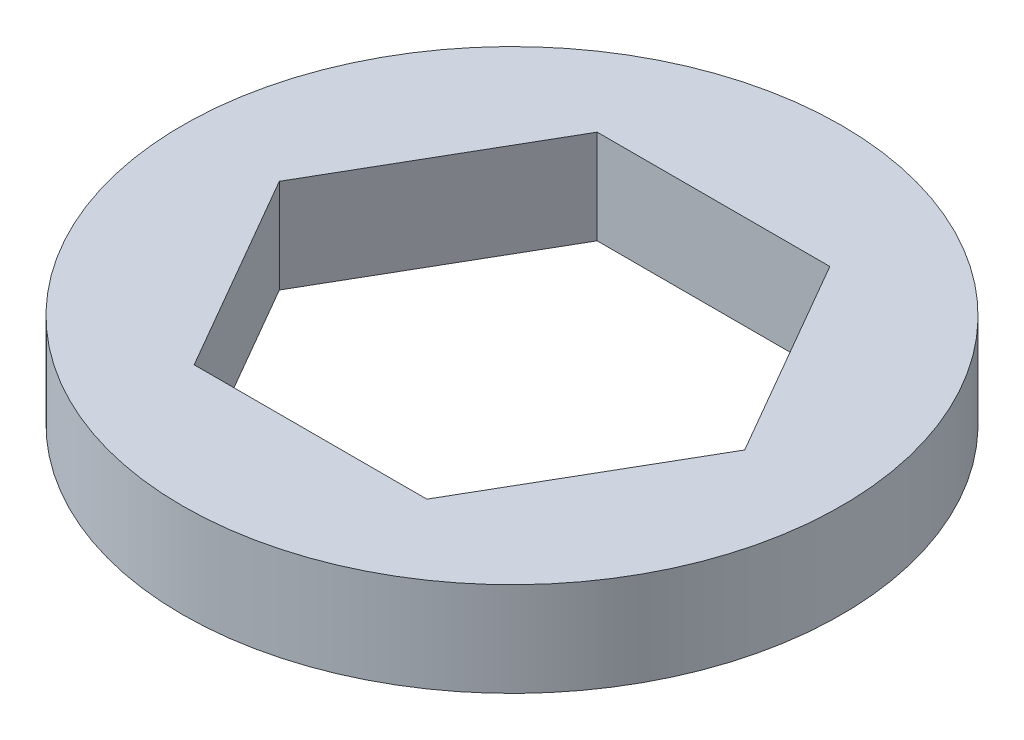
ISO-10303-21;
HEADER;
FILE_DESCRIPTION(('STEP AP214'),'2;1');
FILE_NAME('part.step','',(''),(''),'','','');
FILE_SCHEMA(('AUTOMOTIVE_DESIGN { 1 0 10303 214 1 1 1 1 }'));
ENDSEC;
DATA;
#1=APPLICATION_CONTEXT('core data for automotive mechanical design processes');
#2=APPLICATION_PROTOCOL_DEFINITION('international standard','automotive_design',2000,#1);
#3=PRODUCT_CONTEXT('',#1,'mechanical');
#4=PRODUCT('Part','Part','',(#3));
#5=PRODUCT_RELATED_PRODUCT_CATEGORY('part','',(#4));
#6=PRODUCT_DEFINITION_FORMATION('','',#4);
#7=PRODUCT_DEFINITION_CONTEXT('part definition',#1,'design');
#8=PRODUCT_DEFINITION('design','',#6,#7);
#9=PRODUCT_DEFINITION_SHAPE('','',#8);
#10=(LENGTH_UNIT() NAMED_UNIT(*) SI_UNIT(.MILLI.,.METRE.));
#11=(NAMED_UNIT(*) PLANE_ANGLE_UNIT() SI_UNIT($,.RADIAN.));
#12=(NAMED_UNIT(*) SI_UNIT($,.STERADIAN.) SOLID_ANGLE_UNIT());
#13=UNCERTAINTY_MEASURE_WITH_UNIT(LENGTH_MEASURE(1.E-05),#10,'distance_accuracy_value','');
#14=(GEOMETRIC_REPRESENTATION_CONTEXT(3) GLOBAL_UNCERTAINTY_ASSIGNED_CONTEXT((#13)) GLOBAL_UNIT_ASSIGNED_CONTEXT((#10,
#11,#12)) REPRESENTATION_CONTEXT('',''));
#15=CARTESIAN_POINT('',(0.,0.,0.));
#16=DIRECTION('',(0.,0.,1.));
#17=DIRECTION('',(1.,0.,0.));
#18=AXIS2_PLACEMENT_3D('',#15,#16,#17);
#19=CARTESIAN_POINT('',(0.,3.175,0.));
#20=DIRECTION('',(0.,1.,0.));
#21=DIRECTION('',(0.,0.,1.));
#22=AXIS2_PLACEMENT_3D('',#19,#20,#21);
#23=PLANE('',#22);
#24=CARTESIAN_POINT('',(0.,3.175,0.));
#25=DIRECTION('',(0.,1.,0.));
#26=DIRECTION('',(0.,0.,1.));
#27=AXIS2_PLACEMENT_3D('',#24,#25,#26);
#28=CIRCLE('',#27,11.1125);
#29=CARTESIAN_POINT('',(0.,3.175,11.1125));
#30=VERTEX_POINT('',#29);
#31=EDGE_CURVE('E11',#30,#30,#28,.T.);
#32=ORIENTED_EDGE('',*,*,#31,.T.);
#33=EDGE_LOOP('',(#32));
#34=FACE_BOUND('',#33,.T.);
#35=DIRECTION('',(-0.5,0.,-0.866025403784439));
#36=VECTOR('',#35,1.);
#37=CARTESIAN_POINT('',(7.84561280801783,3.175,0.));
#38=LINE('',#37,#36);
#39=CARTESIAN_POINT('',(7.84561280801783,3.175,0.));
#40=VERTEX_POINT('',#39);
#41=CARTESIAN_POINT('',(3.9228064040089,3.175,-6.79450000000002));
#42=VERTEX_POINT('',#41);
#43=EDGE_CURVE('E93',#40,#42,#38,.T.);
#44=ORIENTED_EDGE('',*,*,#43,.F.);
#45=DIRECTION('',(0.5,0.,-0.866025403784439));
#46=VECTOR('',#45,1.);
#47=CARTESIAN_POINT('',(3.92280640400891,3.175,6.79450000000001));
#48=LINE('',#47,#46);
#49=CARTESIAN_POINT('',(3.92280640400891,3.175,6.79450000000001));
#50=VERTEX_POINT('',#49);
#51=EDGE_CURVE('E85',#50,#40,#48,.T.);
#52=ORIENTED_EDGE('',*,*,#51,.F.);
#53=DIRECTION('',(1.,0.,0.));
#54=VECTOR('',#53,1.);
#55=CARTESIAN_POINT('',(-3.92280640400892,3.175,6.79450000000001));
#56=LINE('',#55,#54);
#57=CARTESIAN_POINT('',(-3.92280640400892,3.175,6.79450000000001));
#58=VERTEX_POINT('',#57);
#59=EDGE_CURVE('E113',#58,#50,#56,.T.);
#60=ORIENTED_EDGE('',*,*,#59,.F.);
#61=DIRECTION('',(0.5,0.,0.866025403784439));
#62=VECTOR('',#61,1.);
#63=CARTESIAN_POINT('',(-7.84561280801784,3.175,0.));
#64=LINE('',#63,#62);
#65=CARTESIAN_POINT('',(-7.84561280801784,3.175,0.));
#66=VERTEX_POINT('',#65);
#67=EDGE_CURVE('E111',#66,#58,#64,.T.);
#68=ORIENTED_EDGE('',*,*,#67,.F.);
#69=DIRECTION('',(-0.5,0.,0.866025403784439));
#70=VECTOR('',#69,1.);
#71=CARTESIAN_POINT('',(-3.92280640400892,3.175,-6.79450000000002));
#72=LINE('',#71,#70);
#73=CARTESIAN_POINT('',(-3.92280640400892,3.175,-6.79450000000002));
#74=VERTEX_POINT('',#73);
#75=EDGE_CURVE('E107',#74,#66,#72,.T.);
#76=ORIENTED_EDGE('',*,*,#75,.F.);
#77=DIRECTION('',(-1.,0.,0.));
#78=VECTOR('',#77,1.);
#79=CARTESIAN_POINT('',(3.9228064040089,3.175,-6.79450000000002));
#80=LINE('',#79,#78);
#81=EDGE_CURVE('E105',#42,#74,#80,.T.);
#82=ORIENTED_EDGE('',*,*,#81,.F.);
#83=EDGE_LOOP('',(#44,#52,#60,#68,#76,#82));
#84=FACE_BOUND('',#83,.T.);
#85=ADVANCED_FACE('F32',(#34,#84),#23,.T.);
#86=CARTESIAN_POINT('',(0.,0.,0.));
#87=DIRECTION('',(0.,1.,0.));
#88=DIRECTION('',(0.,0.,1.));
#89=AXIS2_PLACEMENT_3D('',#86,#87,#88);
#90=PLANE('',#89);
#91=CARTESIAN_POINT('',(0.,0.,0.));
#92=DIRECTION('',(0.,1.,0.));
#93=DIRECTION('',(0.,0.,1.));
#94=AXIS2_PLACEMENT_3D('',#91,#92,#93);
#95=CIRCLE('',#94,11.1125);
#96=CARTESIAN_POINT('',(0.,0.,11.1125));
#97=VERTEX_POINT('',#96);
#98=EDGE_CURVE('E36',#97,#97,#95,.T.);
#99=ORIENTED_EDGE('',*,*,#98,.F.);
#100=EDGE_LOOP('',(#99));
#101=FACE_BOUND('',#100,.T.);
#102=DIRECTION('',(0.5,0.,-0.866025403784439));
#103=VECTOR('',#102,1.);
#104=CARTESIAN_POINT('',(3.92280640400891,0.,6.79450000000001));
#105=LINE('',#104,#103);
#106=CARTESIAN_POINT('',(3.92280640400891,0.,6.79450000000001));
#107=VERTEX_POINT('',#106);
#108=CARTESIAN_POINT('',(7.84561280801783,0.,0.));
#109=VERTEX_POINT('',#108);
#110=EDGE_CURVE('E55',#107,#109,#105,.T.);
#111=ORIENTED_EDGE('',*,*,#110,.T.);
#112=DIRECTION('',(-0.5,0.,-0.866025403784439));
#113=VECTOR('',#112,1.);
#114=CARTESIAN_POINT('',(7.84561280801783,0.,0.));
#115=LINE('',#114,#113);
#116=CARTESIAN_POINT('',(3.9228064040089,0.,-6.79450000000002));
#117=VERTEX_POINT('',#116);
#118=EDGE_CURVE('E100',#109,#117,#115,.T.);
#119=ORIENTED_EDGE('',*,*,#118,.T.);
#120=DIRECTION('',(-1.,0.,0.));
#121=VECTOR('',#120,1.);
#122=CARTESIAN_POINT('',(3.9228064040089,0.,-6.79450000000002));
#123=LINE('',#122,#121);
#124=CARTESIAN_POINT('',(-3.92280640400892,0.,-6.79450000000002));
#125=VERTEX_POINT('',#124);
#126=EDGE_CURVE('E117',#117,#125,#123,.T.);
#127=ORIENTED_EDGE('',*,*,#126,.T.);
#128=DIRECTION('',(-0.5,0.,0.866025403784439));
#129=VECTOR('',#128,1.);
#130=CARTESIAN_POINT('',(-3.92280640400892,0.,-6.79450000000002));
#131=LINE('',#130,#129);
#132=CARTESIAN_POINT('',(-7.84561280801784,0.,0.));
#133=VERTEX_POINT('',#132);
#134=EDGE_CURVE('E120',#125,#133,#131,.T.);
#135=ORIENTED_EDGE('',*,*,#134,.T.);
#136=DIRECTION('',(0.5,0.,0.866025403784439));
#137=VECTOR('',#136,1.);
#138=CARTESIAN_POINT('',(-7.84561280801784,0.,0.));
#139=LINE('',#138,#137);
#140=CARTESIAN_POINT('',(-3.92280640400892,0.,6.79450000000001));
#141=VERTEX_POINT('',#140);
#142=EDGE_CURVE('E123',#133,#141,#139,.T.);
#143=ORIENTED_EDGE('',*,*,#142,.T.);
#144=DIRECTION('',(1.,0.,0.));
#145=VECTOR('',#144,1.);
#146=CARTESIAN_POINT('',(-3.92280640400892,0.,6.79450000000001));
#147=LINE('',#146,#145);
#148=EDGE_CURVE('E94',#141,#107,#147,.T.);
#149=ORIENTED_EDGE('',*,*,#148,.T.);
#150=EDGE_LOOP('',(#111,#119,#127,#135,#143,#149));
#151=FACE_BOUND('',#150,.T.);
#152=ADVANCED_FACE('F140',(#101,#151),#90,.F.);
#153=CARTESIAN_POINT('',(0.,3.175,0.));
#154=DIRECTION('',(0.,-1.,0.));
#155=DIRECTION('',(0.,0.,-1.));
#156=AXIS2_PLACEMENT_3D('',#153,#154,#155);
#157=CYLINDRICAL_SURFACE('',#156,11.1125);
#158=ORIENTED_EDGE('',*,*,#31,.F.);
#159=EDGE_LOOP('',(#158));
#160=FACE_BOUND('',#159,.T.);
#161=ORIENTED_EDGE('',*,*,#98,.T.);
#162=EDGE_LOOP('',(#161));
#163=FACE_BOUND('',#162,.T.);
#164=ADVANCED_FACE('F34',(#160,#163),#157,.T.);
#165=CARTESIAN_POINT('',(3.92280640400891,3.175,6.79450000000001));
#166=DIRECTION('',(-0.866025403784439,0.,-0.5));
#167=DIRECTION('',(-0.5,0.,0.866025403784439));
#168=AXIS2_PLACEMENT_3D('',#165,#166,#167);
#169=PLANE('',#168);
#170=ORIENTED_EDGE('',*,*,#110,.F.);
#171=DIRECTION('',(0.,-1.,0.));
#172=VECTOR('',#171,1.);
#173=CARTESIAN_POINT('',(3.92280640400891,3.175,6.79450000000001));
#174=LINE('',#173,#172);
#175=EDGE_CURVE('E89',#50,#107,#174,.T.);
#176=ORIENTED_EDGE('',*,*,#175,.F.);
#177=ORIENTED_EDGE('',*,*,#51,.T.);
#178=DIRECTION('',(0.,-1.,0.));
#179=VECTOR('',#178,1.);
#180=CARTESIAN_POINT('',(7.84561280801783,3.175,0.));
#181=LINE('',#180,#179);
#182=EDGE_CURVE('E88',#40,#109,#181,.T.);
#183=ORIENTED_EDGE('',*,*,#182,.T.);
#184=EDGE_LOOP('',(#170,#176,#177,#183));
#185=FACE_BOUND('',#184,.T.);
#186=ADVANCED_FACE('F87',(#185),#169,.T.);
#187=CARTESIAN_POINT('',(7.84561280801783,3.175,0.));
#188=DIRECTION('',(-0.866025403784439,0.,0.5));
#189=DIRECTION('',(0.5,0.,0.866025403784439));
#190=AXIS2_PLACEMENT_3D('',#187,#188,#189);
#191=PLANE('',#190);
#192=ORIENTED_EDGE('',*,*,#118,.F.);
#193=ORIENTED_EDGE('',*,*,#182,.F.);
#194=ORIENTED_EDGE('',*,*,#43,.T.);
#195=DIRECTION('',(0.,-1.,0.));
#196=VECTOR('',#195,1.);
#197=CARTESIAN_POINT('',(3.9228064040089,3.175,-6.79450000000002));
#198=LINE('',#197,#196);
#199=EDGE_CURVE('E101',#42,#117,#198,.T.);
#200=ORIENTED_EDGE('',*,*,#199,.T.);
#201=EDGE_LOOP('',(#192,#193,#194,#200));
#202=FACE_BOUND('',#201,.T.);
#203=ADVANCED_FACE('F97',(#202),#191,.T.);
#204=CARTESIAN_POINT('',(3.9228064040089,3.175,-6.79450000000002));
#205=DIRECTION('',(0.,0.,1.));
#206=DIRECTION('',(1.,0.,0.));
#207=AXIS2_PLACEMENT_3D('',#204,#205,#206);
#208=PLANE('',#207);
#209=ORIENTED_EDGE('',*,*,#126,.F.);
#210=ORIENTED_EDGE('',*,*,#199,.F.);
#211=ORIENTED_EDGE('',*,*,#81,.T.);
#212=DIRECTION('',(0.,-1.,0.));
#213=VECTOR('',#212,1.);
#214=CARTESIAN_POINT('',(-3.92280640400892,3.175,-6.79450000000002));
#215=LINE('',#214,#213);
#216=EDGE_CURVE('E132',#74,#125,#215,.T.);
#217=ORIENTED_EDGE('',*,*,#216,.T.);
#218=EDGE_LOOP('',(#209,#210,#211,#217));
#219=FACE_BOUND('',#218,.T.);
#220=ADVANCED_FACE('F136',(#219),#208,.T.);
#221=CARTESIAN_POINT('',(-3.92280640400892,3.175,-6.79450000000002));
#222=DIRECTION('',(0.866025403784439,0.,0.5));
#223=DIRECTION('',(0.5,0.,-0.866025403784439));
#224=AXIS2_PLACEMENT_3D('',#221,#222,#223);
#225=PLANE('',#224);
#226=ORIENTED_EDGE('',*,*,#134,.F.);
#227=ORIENTED_EDGE('',*,*,#216,.F.);
#228=ORIENTED_EDGE('',*,*,#75,.T.);
#229=DIRECTION('',(0.,-1.,0.));
#230=VECTOR('',#229,1.);
#231=CARTESIAN_POINT('',(-7.84561280801784,3.175,0.));
#232=LINE('',#231,#230);
#233=EDGE_CURVE('E130',#66,#133,#232,.T.);
#234=ORIENTED_EDGE('',*,*,#233,.T.);
#235=EDGE_LOOP('',(#226,#227,#228,#234));
#236=FACE_BOUND('',#235,.T.);
#237=ADVANCED_FACE('F148',(#236),#225,.T.);
#238=CARTESIAN_POINT('',(-7.84561280801784,3.175,0.));
#239=DIRECTION('',(0.866025403784439,0.,-0.5));
#240=DIRECTION('',(-0.5,0.,-0.866025403784439));
#241=AXIS2_PLACEMENT_3D('',#238,#239,#240);
#242=PLANE('',#241);
#243=ORIENTED_EDGE('',*,*,#142,.F.);
#244=ORIENTED_EDGE('',*,*,#233,.F.);
#245=ORIENTED_EDGE('',*,*,#67,.T.);
#246=DIRECTION('',(0.,-1.,0.));
#247=VECTOR('',#246,1.);
#248=CARTESIAN_POINT('',(-3.92280640400892,3.175,6.79450000000001));
#249=LINE('',#248,#247);
#250=EDGE_CURVE('E47',#58,#141,#249,.T.);
#251=ORIENTED_EDGE('',*,*,#250,.T.);
#252=EDGE_LOOP('',(#243,#244,#245,#251));
#253=FACE_BOUND('',#252,.T.);
#254=ADVANCED_FACE('F146',(#253),#242,.T.);
#255=CARTESIAN_POINT('',(-3.92280640400892,3.175,6.79450000000001));
#256=DIRECTION('',(0.,0.,-1.));
#257=DIRECTION('',(-1.,0.,0.));
#258=AXIS2_PLACEMENT_3D('',#255,#256,#257);
#259=PLANE('',#258);
#260=ORIENTED_EDGE('',*,*,#148,.F.);
#261=ORIENTED_EDGE('',*,*,#250,.F.);
#262=ORIENTED_EDGE('',*,*,#59,.T.);
#263=ORIENTED_EDGE('',*,*,#175,.T.);
#264=EDGE_LOOP('',(#260,#261,#262,#263));
#265=FACE_BOUND('',#264,.T.);
#266=ADVANCED_FACE('F142',(#265),#259,.T.);
#267=CLOSED_SHELL('',(#85,#152,#164,#186,#203,#220,#237,#254,#266));
#268=MANIFOLD_SOLID_BREP('B2',#267);
#269=ADVANCED_BREP_SHAPE_REPRESENTATION('',(#18,#268),#14);
#270=SHAPE_DEFINITION_REPRESENTATION(#9,#269);
ENDSEC;
END-ISO-10303-21;
